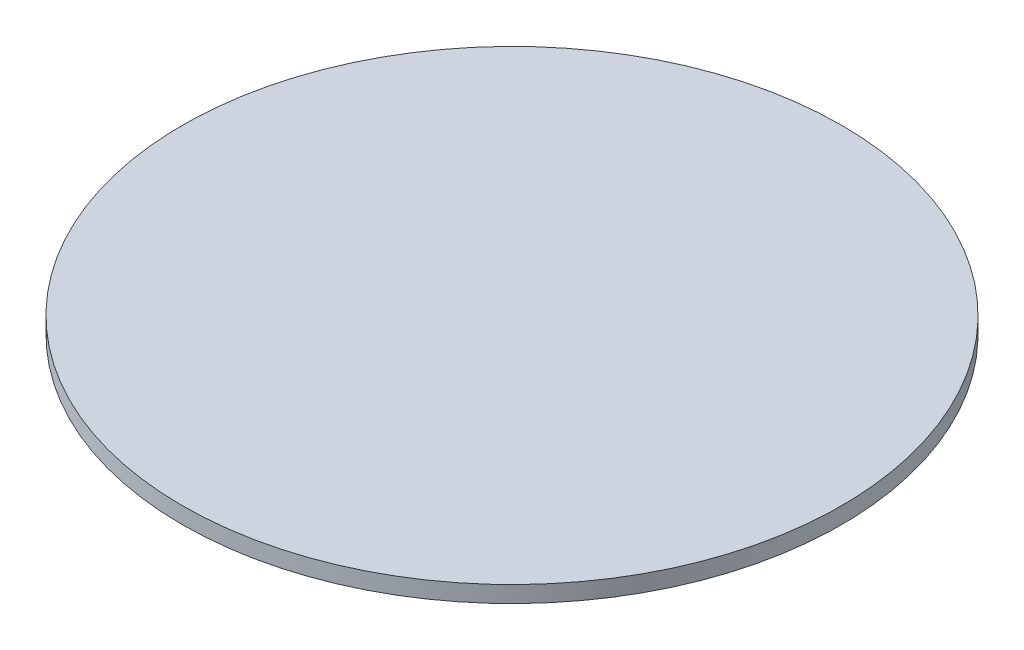
ISO-10303-21;
HEADER;
FILE_DESCRIPTION(('STEP AP214'),'2;1');
FILE_NAME('part.step','',(''),(''),'','','');
FILE_SCHEMA(('AUTOMOTIVE_DESIGN { 1 0 10303 214 1 1 1 1 }'));
ENDSEC;
DATA;
#1=APPLICATION_CONTEXT('core data for automotive mechanical design processes');
#2=APPLICATION_PROTOCOL_DEFINITION('international standard','automotive_design',2000,#1);
#3=PRODUCT_CONTEXT('',#1,'mechanical');
#4=PRODUCT('Part','Part','',(#3));
#5=PRODUCT_RELATED_PRODUCT_CATEGORY('part','',(#4));
#6=PRODUCT_DEFINITION_FORMATION('','',#4);
#7=PRODUCT_DEFINITION_CONTEXT('part definition',#1,'design');
#8=PRODUCT_DEFINITION('design','',#6,#7);
#9=PRODUCT_DEFINITION_SHAPE('','',#8);
#10=(LENGTH_UNIT() NAMED_UNIT(*) SI_UNIT(.MILLI.,.METRE.));
#11=(NAMED_UNIT(*) PLANE_ANGLE_UNIT() SI_UNIT($,.RADIAN.));
#12=(NAMED_UNIT(*) SI_UNIT($,.STERADIAN.) SOLID_ANGLE_UNIT());
#13=UNCERTAINTY_MEASURE_WITH_UNIT(LENGTH_MEASURE(1.E-05),#10,'distance_accuracy_value','');
#14=(GEOMETRIC_REPRESENTATION_CONTEXT(3) GLOBAL_UNCERTAINTY_ASSIGNED_CONTEXT((#13)) GLOBAL_UNIT_ASSIGNED_CONTEXT((#10,
#11,#12)) REPRESENTATION_CONTEXT('',''));
#15=CARTESIAN_POINT('',(0.,0.,0.));
#16=DIRECTION('',(0.,0.,1.));
#17=DIRECTION('',(1.,0.,0.));
#18=AXIS2_PLACEMENT_3D('',#15,#16,#17);
#19=CARTESIAN_POINT('',(0.,-2.08436697366508,0.));
#20=DIRECTION('',(0.,-1.,0.));
#21=DIRECTION('',(0.,0.,-1.));
#22=AXIS2_PLACEMENT_3D('',#19,#20,#21);
#23=CYLINDRICAL_SURFACE('',#22,4.);
#24=CARTESIAN_POINT('',(0.,-2.08436697366508,0.));
#25=DIRECTION('',(0.,-1.,0.));
#26=DIRECTION('',(0.,0.,-1.));
#27=AXIS2_PLACEMENT_3D('',#24,#25,#26);
#28=CIRCLE('',#27,4.);
#29=CARTESIAN_POINT('',(0.,-2.08436697366508,-4.));
#30=VERTEX_POINT('',#29);
#31=EDGE_CURVE('E10',#30,#30,#28,.T.);
#32=ORIENTED_EDGE('',*,*,#31,.T.);
#33=EDGE_LOOP('',(#32));
#34=FACE_BOUND('',#33,.T.);
#35=CARTESIAN_POINT('',(0.,-2.28436697366508,0.));
#36=DIRECTION('',(0.,-1.,0.));
#37=DIRECTION('',(0.,0.,-1.));
#38=AXIS2_PLACEMENT_3D('',#35,#36,#37);
#39=CIRCLE('',#38,4.);
#40=CARTESIAN_POINT('',(0.,-2.28436697366508,-4.));
#41=VERTEX_POINT('',#40);
#42=EDGE_CURVE('E40',#41,#41,#39,.T.);
#43=ORIENTED_EDGE('',*,*,#42,.F.);
#44=EDGE_LOOP('',(#43));
#45=FACE_BOUND('',#44,.T.);
#46=ADVANCED_FACE('F37',(#34,#45),#23,.T.);
#47=CARTESIAN_POINT('',(0.,-2.08436697366508,0.));
#48=DIRECTION('',(0.,-1.,0.));
#49=DIRECTION('',(0.,0.,-1.));
#50=AXIS2_PLACEMENT_3D('',#47,#48,#49);
#51=PLANE('',#50);
#52=ORIENTED_EDGE('',*,*,#31,.F.);
#53=EDGE_LOOP('',(#52));
#54=FACE_BOUND('',#53,.T.);
#55=ADVANCED_FACE('F52',(#54),#51,.F.);
#56=CARTESIAN_POINT('',(0.,-2.28436697366508,0.));
#57=DIRECTION('',(0.,-1.,0.));
#58=DIRECTION('',(0.,0.,-1.));
#59=AXIS2_PLACEMENT_3D('',#56,#57,#58);
#60=PLANE('',#59);
#61=ORIENTED_EDGE('',*,*,#42,.T.);
#62=EDGE_LOOP('',(#61));
#63=FACE_BOUND('',#62,.T.);
#64=ADVANCED_FACE('F49',(#63),#60,.T.);
#65=CLOSED_SHELL('',(#46,#55,#64));
#66=MANIFOLD_SOLID_BREP('B2',#65);
#67=ADVANCED_BREP_SHAPE_REPRESENTATION('',(#18,#66),#14);
#68=SHAPE_DEFINITION_REPRESENTATION(#9,#67);
ENDSEC;
END-ISO-10303-21;
